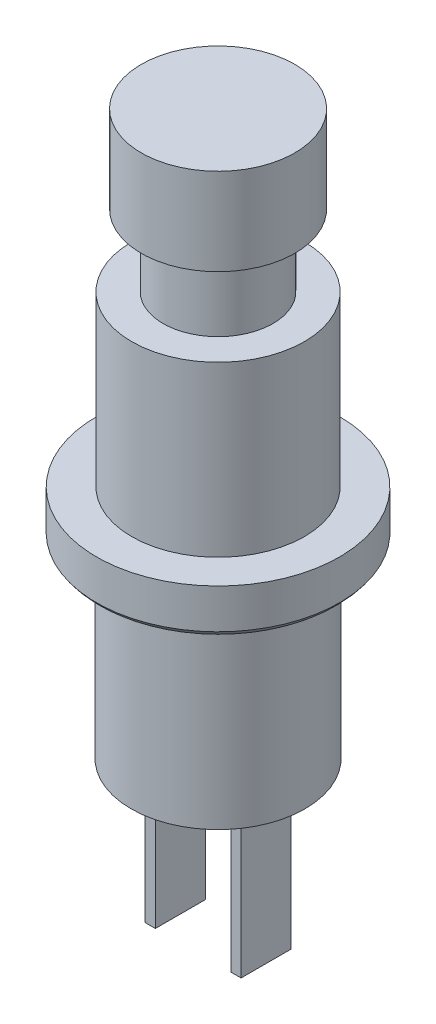
ISO-10303-21;
HEADER;
FILE_DESCRIPTION(('STEP AP214'),'2;1');
FILE_NAME('part.step','',(''),(''),'','','');
FILE_SCHEMA(('AUTOMOTIVE_DESIGN { 1 0 10303 214 1 1 1 1 }'));
ENDSEC;
DATA;
#1=APPLICATION_CONTEXT('core data for automotive mechanical design processes');
#2=APPLICATION_PROTOCOL_DEFINITION('international standard','automotive_design',2000,#1);
#3=PRODUCT_CONTEXT('',#1,'mechanical');
#4=PRODUCT('Part','Part','',(#3));
#5=PRODUCT_RELATED_PRODUCT_CATEGORY('part','',(#4));
#6=PRODUCT_DEFINITION_FORMATION('','',#4);
#7=PRODUCT_DEFINITION_CONTEXT('part definition',#1,'design');
#8=PRODUCT_DEFINITION('design','',#6,#7);
#9=PRODUCT_DEFINITION_SHAPE('','',#8);
#10=(LENGTH_UNIT() NAMED_UNIT(*) SI_UNIT(.MILLI.,.METRE.));
#11=(NAMED_UNIT(*) PLANE_ANGLE_UNIT() SI_UNIT($,.RADIAN.));
#12=(NAMED_UNIT(*) SI_UNIT($,.STERADIAN.) SOLID_ANGLE_UNIT());
#13=UNCERTAINTY_MEASURE_WITH_UNIT(LENGTH_MEASURE(1.E-05),#10,'distance_accuracy_value','');
#14=(GEOMETRIC_REPRESENTATION_CONTEXT(3) GLOBAL_UNCERTAINTY_ASSIGNED_CONTEXT((#13)) GLOBAL_UNIT_ASSIGNED_CONTEXT((#10,
#11,#12)) REPRESENTATION_CONTEXT('',''));
#15=CARTESIAN_POINT('',(0.,0.,0.));
#16=DIRECTION('',(0.,0.,1.));
#17=DIRECTION('',(1.,0.,0.));
#18=AXIS2_PLACEMENT_3D('',#15,#16,#17);
#19=CARTESIAN_POINT('',(3.4,-22.,0.));
#20=DIRECTION('',(0.,-1.,0.));
#21=DIRECTION('',(0.,0.,-1.));
#22=AXIS2_PLACEMENT_3D('',#19,#20,#21);
#23=PLANE('',#22);
#24=CARTESIAN_POINT('',(0.,-22.,0.));
#25=DIRECTION('',(0.,-1.,0.));
#26=DIRECTION('',(0.,0.,-1.));
#27=AXIS2_PLACEMENT_3D('',#24,#25,#26);
#28=CIRCLE('',#27,3.4);
#29=CARTESIAN_POINT('',(0.,-22.,-3.4));
#30=VERTEX_POINT('',#29);
#31=EDGE_CURVE('E171',#30,#30,#28,.T.);
#32=ORIENTED_EDGE('',*,*,#31,.T.);
#33=EDGE_LOOP('',(#32));
#34=FACE_BOUND('',#33,.T.);
#35=DIRECTION('',(1.,0.,0.));
#36=VECTOR('',#35,1.);
#37=CARTESIAN_POINT('',(-1.875,-22.,-0.975));
#38=LINE('',#37,#36);
#39=CARTESIAN_POINT('',(-1.875,-22.,-0.975));
#40=VERTEX_POINT('',#39);
#41=CARTESIAN_POINT('',(-1.475,-22.,-0.975));
#42=VERTEX_POINT('',#41);
#43=EDGE_CURVE('E143',#40,#42,#38,.T.);
#44=ORIENTED_EDGE('',*,*,#43,.F.);
#45=DIRECTION('',(0.,0.,-1.));
#46=VECTOR('',#45,1.);
#47=CARTESIAN_POINT('',(-1.875,-22.,0.975));
#48=LINE('',#47,#46);
#49=CARTESIAN_POINT('',(-1.875,-22.,0.975));
#50=VERTEX_POINT('',#49);
#51=EDGE_CURVE('E140',#50,#40,#48,.T.);
#52=ORIENTED_EDGE('',*,*,#51,.F.);
#53=DIRECTION('',(-1.,0.,0.));
#54=VECTOR('',#53,1.);
#55=CARTESIAN_POINT('',(-1.875,-22.,0.975));
#56=LINE('',#55,#54);
#57=CARTESIAN_POINT('',(-1.475,-22.,0.975));
#58=VERTEX_POINT('',#57);
#59=EDGE_CURVE('E152',#58,#50,#56,.T.);
#60=ORIENTED_EDGE('',*,*,#59,.F.);
#61=DIRECTION('',(0.,0.,1.));
#62=VECTOR('',#61,1.);
#63=CARTESIAN_POINT('',(-1.475,-22.,0.975));
#64=LINE('',#63,#62);
#65=EDGE_CURVE('E160',#42,#58,#64,.T.);
#66=ORIENTED_EDGE('',*,*,#65,.F.);
#67=EDGE_LOOP('',(#44,#52,#60,#66));
#68=FACE_BOUND('',#67,.T.);
#69=DIRECTION('',(1.,0.,0.));
#70=VECTOR('',#69,1.);
#71=CARTESIAN_POINT('',(1.475,-22.,-0.975));
#72=LINE('',#71,#70);
#73=CARTESIAN_POINT('',(1.475,-22.,-0.975));
#74=VERTEX_POINT('',#73);
#75=CARTESIAN_POINT('',(1.875,-22.,-0.975));
#76=VERTEX_POINT('',#75);
#77=EDGE_CURVE('E434',#74,#76,#72,.T.);
#78=ORIENTED_EDGE('',*,*,#77,.F.);
#79=DIRECTION('',(0.,0.,-1.));
#80=VECTOR('',#79,1.);
#81=CARTESIAN_POINT('',(1.475,-22.,0.975));
#82=LINE('',#81,#80);
#83=CARTESIAN_POINT('',(1.475,-22.,0.975));
#84=VERTEX_POINT('',#83);
#85=EDGE_CURVE('E138',#84,#74,#82,.T.);
#86=ORIENTED_EDGE('',*,*,#85,.F.);
#87=DIRECTION('',(-1.,0.,0.));
#88=VECTOR('',#87,1.);
#89=CARTESIAN_POINT('',(1.475,-22.,0.975));
#90=LINE('',#89,#88);
#91=CARTESIAN_POINT('',(1.875,-22.,0.975));
#92=VERTEX_POINT('',#91);
#93=EDGE_CURVE('E134',#92,#84,#90,.T.);
#94=ORIENTED_EDGE('',*,*,#93,.F.);
#95=DIRECTION('',(0.,0.,1.));
#96=VECTOR('',#95,1.);
#97=CARTESIAN_POINT('',(1.875,-22.,0.975));
#98=LINE('',#97,#96);
#99=EDGE_CURVE('E431',#76,#92,#98,.T.);
#100=ORIENTED_EDGE('',*,*,#99,.F.);
#101=EDGE_LOOP('',(#78,#86,#94,#100));
#102=FACE_BOUND('',#101,.T.);
#103=ADVANCED_FACE('F49',(#34,#68,#102),#23,.T.);
#104=CARTESIAN_POINT('',(0.,0.,0.));
#105=DIRECTION('',(0.,1.,0.));
#106=DIRECTION('',(0.,0.,1.));
#107=AXIS2_PLACEMENT_3D('',#104,#105,#106);
#108=PLANE('',#107);
#109=CARTESIAN_POINT('',(0.,0.,0.));
#110=DIRECTION('',(0.,-1.,0.));
#111=DIRECTION('',(0.,0.,-1.));
#112=AXIS2_PLACEMENT_3D('',#109,#110,#111);
#113=CIRCLE('',#112,3.);
#114=CARTESIAN_POINT('',(0.,0.,-3.));
#115=VERTEX_POINT('',#114);
#116=EDGE_CURVE('E13',#115,#115,#113,.T.);
#117=ORIENTED_EDGE('',*,*,#116,.F.);
#118=EDGE_LOOP('',(#117));
#119=FACE_BOUND('',#118,.T.);
#120=ADVANCED_FACE('F51',(#119),#108,.T.);
#121=CARTESIAN_POINT('',(0.,-223.6231578964,0.));
#122=DIRECTION('',(0.,-1.,0.));
#123=DIRECTION('',(0.,0.,-1.));
#124=AXIS2_PLACEMENT_3D('',#121,#122,#123);
#125=CYLINDRICAL_SURFACE('',#124,3.);
#126=ORIENTED_EDGE('',*,*,#116,.T.);
#127=EDGE_LOOP('',(#126));
#128=FACE_BOUND('',#127,.T.);
#129=CARTESIAN_POINT('',(0.,-3.39999999999999,0.));
#130=DIRECTION('',(0.,-1.,0.));
#131=DIRECTION('',(0.,0.,-1.));
#132=AXIS2_PLACEMENT_3D('',#129,#130,#131);
#133=CIRCLE('',#132,3.);
#134=CARTESIAN_POINT('',(0.,-3.39999999999999,-3.));
#135=VERTEX_POINT('',#134);
#136=EDGE_CURVE('E57',#135,#135,#133,.T.);
#137=ORIENTED_EDGE('',*,*,#136,.F.);
#138=EDGE_LOOP('',(#137));
#139=FACE_BOUND('',#138,.T.);
#140=ADVANCED_FACE('F203',(#128,#139),#125,.T.);
#141=CARTESIAN_POINT('',(3.,-3.4,0.));
#142=DIRECTION('',(0.,-1.,0.));
#143=DIRECTION('',(0.,0.,-1.));
#144=AXIS2_PLACEMENT_3D('',#141,#142,#143);
#145=PLANE('',#144);
#146=ORIENTED_EDGE('',*,*,#136,.T.);
#147=EDGE_LOOP('',(#146));
#148=FACE_BOUND('',#147,.T.);
#149=CARTESIAN_POINT('',(0.,-3.39999999999999,0.));
#150=DIRECTION('',(0.,-1.,0.));
#151=DIRECTION('',(0.,0.,-1.));
#152=AXIS2_PLACEMENT_3D('',#149,#150,#151);
#153=CIRCLE('',#152,2.15);
#154=CARTESIAN_POINT('',(0.,-3.39999999999999,-2.15));
#155=VERTEX_POINT('',#154);
#156=EDGE_CURVE('E195',#155,#155,#153,.T.);
#157=ORIENTED_EDGE('',*,*,#156,.F.);
#158=EDGE_LOOP('',(#157));
#159=FACE_BOUND('',#158,.T.);
#160=ADVANCED_FACE('F200',(#148,#159),#145,.T.);
#161=CARTESIAN_POINT('',(0.,-223.6231578964,0.));
#162=DIRECTION('',(0.,-1.,0.));
#163=DIRECTION('',(0.,0.,-1.));
#164=AXIS2_PLACEMENT_3D('',#161,#162,#163);
#165=CYLINDRICAL_SURFACE('',#164,2.15);
#166=ORIENTED_EDGE('',*,*,#156,.T.);
#167=EDGE_LOOP('',(#166));
#168=FACE_BOUND('',#167,.T.);
#169=CARTESIAN_POINT('',(0.,-6.20000000000001,0.));
#170=DIRECTION('',(0.,-1.,0.));
#171=DIRECTION('',(0.,0.,-1.));
#172=AXIS2_PLACEMENT_3D('',#169,#170,#171);
#173=CIRCLE('',#172,2.15);
#174=CARTESIAN_POINT('',(0.,-6.20000000000001,-2.15));
#175=VERTEX_POINT('',#174);
#176=EDGE_CURVE('E192',#175,#175,#173,.T.);
#177=ORIENTED_EDGE('',*,*,#176,.F.);
#178=EDGE_LOOP('',(#177));
#179=FACE_BOUND('',#178,.T.);
#180=ADVANCED_FACE('F210',(#168,#179),#165,.T.);
#181=CARTESIAN_POINT('',(2.15,-6.2,0.));
#182=DIRECTION('',(0.,1.,0.));
#183=DIRECTION('',(0.,0.,1.));
#184=AXIS2_PLACEMENT_3D('',#181,#182,#183);
#185=PLANE('',#184);
#186=ORIENTED_EDGE('',*,*,#176,.T.);
#187=EDGE_LOOP('',(#186));
#188=FACE_BOUND('',#187,.T.);
#189=CARTESIAN_POINT('',(0.,-6.20000000000001,0.));
#190=DIRECTION('',(0.,-1.,0.));
#191=DIRECTION('',(0.,0.,-1.));
#192=AXIS2_PLACEMENT_3D('',#189,#190,#191);
#193=CIRCLE('',#192,3.375);
#194=CARTESIAN_POINT('',(0.,-6.20000000000001,-3.375));
#195=VERTEX_POINT('',#194);
#196=EDGE_CURVE('E189',#195,#195,#193,.T.);
#197=ORIENTED_EDGE('',*,*,#196,.F.);
#198=EDGE_LOOP('',(#197));
#199=FACE_BOUND('',#198,.T.);
#200=ADVANCED_FACE('F246',(#188,#199),#185,.T.);
#201=CARTESIAN_POINT('',(0.,-223.6231578964,0.));
#202=DIRECTION('',(0.,-1.,0.));
#203=DIRECTION('',(0.,0.,-1.));
#204=AXIS2_PLACEMENT_3D('',#201,#202,#203);
#205=CYLINDRICAL_SURFACE('',#204,3.375);
#206=ORIENTED_EDGE('',*,*,#196,.T.);
#207=EDGE_LOOP('',(#206));
#208=FACE_BOUND('',#207,.T.);
#209=CARTESIAN_POINT('',(0.,-12.8,0.));
#210=DIRECTION('',(0.,-1.,0.));
#211=DIRECTION('',(0.,0.,-1.));
#212=AXIS2_PLACEMENT_3D('',#209,#210,#211);
#213=CIRCLE('',#212,3.375);
#214=CARTESIAN_POINT('',(0.,-12.8,-3.375));
#215=VERTEX_POINT('',#214);
#216=EDGE_CURVE('E186',#215,#215,#213,.T.);
#217=ORIENTED_EDGE('',*,*,#216,.F.);
#218=EDGE_LOOP('',(#217));
#219=FACE_BOUND('',#218,.T.);
#220=ADVANCED_FACE('F242',(#208,#219),#205,.T.);
#221=CARTESIAN_POINT('',(3.375,-12.8,0.));
#222=DIRECTION('',(0.,1.,0.));
#223=DIRECTION('',(0.,0.,1.));
#224=AXIS2_PLACEMENT_3D('',#221,#222,#223);
#225=PLANE('',#224);
#226=ORIENTED_EDGE('',*,*,#216,.T.);
#227=EDGE_LOOP('',(#226));
#228=FACE_BOUND('',#227,.T.);
#229=CARTESIAN_POINT('',(0.,-12.8,0.));
#230=DIRECTION('',(0.,-1.,0.));
#231=DIRECTION('',(0.,0.,-1.));
#232=AXIS2_PLACEMENT_3D('',#229,#230,#231);
#233=CIRCLE('',#232,4.75);
#234=CARTESIAN_POINT('',(0.,-12.8,-4.75));
#235=VERTEX_POINT('',#234);
#236=EDGE_CURVE('E183',#235,#235,#233,.T.);
#237=ORIENTED_EDGE('',*,*,#236,.F.);
#238=EDGE_LOOP('',(#237));
#239=FACE_BOUND('',#238,.T.);
#240=ADVANCED_FACE('F238',(#228,#239),#225,.T.);
#241=CARTESIAN_POINT('',(0.,-223.6231578964,0.));
#242=DIRECTION('',(0.,-1.,0.));
#243=DIRECTION('',(0.,0.,-1.));
#244=AXIS2_PLACEMENT_3D('',#241,#242,#243);
#245=CYLINDRICAL_SURFACE('',#244,4.75);
#246=ORIENTED_EDGE('',*,*,#236,.T.);
#247=EDGE_LOOP('',(#246));
#248=FACE_BOUND('',#247,.T.);
#249=CARTESIAN_POINT('',(0.,-14.35,0.));
#250=DIRECTION('',(0.,-1.,0.));
#251=DIRECTION('',(0.,0.,-1.));
#252=AXIS2_PLACEMENT_3D('',#249,#250,#251);
#253=CIRCLE('',#252,4.75);
#254=CARTESIAN_POINT('',(0.,-14.35,-4.75));
#255=VERTEX_POINT('',#254);
#256=EDGE_CURVE('E180',#255,#255,#253,.T.);
#257=ORIENTED_EDGE('',*,*,#256,.F.);
#258=EDGE_LOOP('',(#257));
#259=FACE_BOUND('',#258,.T.);
#260=ADVANCED_FACE('F234',(#248,#259),#245,.T.);
#261=CARTESIAN_POINT('',(0.,-13.8,0.));
#262=DIRECTION('',(0.,-1.,0.));
#263=DIRECTION('',(0.,0.,-1.));
#264=AXIS2_PLACEMENT_3D('',#261,#262,#263);
#265=TOROIDAL_SURFACE('',#264,3.9148353455755,1.);
#266=ORIENTED_EDGE('',*,*,#256,.T.);
#267=EDGE_LOOP('',(#266));
#268=FACE_BOUND('',#267,.T.);
#269=CARTESIAN_POINT('',(0.,-14.8,0.));
#270=DIRECTION('',(0.,-1.,0.));
#271=DIRECTION('',(0.,0.,-1.));
#272=AXIS2_PLACEMENT_3D('',#269,#270,#271);
#273=CIRCLE('',#272,3.9148353455755);
#274=CARTESIAN_POINT('',(0.,-14.8,-3.9148353455755));
#275=VERTEX_POINT('',#274);
#276=EDGE_CURVE('E177',#275,#275,#273,.T.);
#277=ORIENTED_EDGE('',*,*,#276,.F.);
#278=EDGE_LOOP('',(#277));
#279=FACE_BOUND('',#278,.T.);
#280=ADVANCED_FACE('F230',(#268,#279),#265,.T.);
#281=CARTESIAN_POINT('',(3.9148353455755,-14.8,0.));
#282=DIRECTION('',(0.,-1.,0.));
#283=DIRECTION('',(0.,0.,-1.));
#284=AXIS2_PLACEMENT_3D('',#281,#282,#283);
#285=PLANE('',#284);
#286=ORIENTED_EDGE('',*,*,#276,.T.);
#287=EDGE_LOOP('',(#286));
#288=FACE_BOUND('',#287,.T.);
#289=CARTESIAN_POINT('',(0.,-14.8,0.));
#290=DIRECTION('',(0.,-1.,0.));
#291=DIRECTION('',(0.,0.,-1.));
#292=AXIS2_PLACEMENT_3D('',#289,#290,#291);
#293=CIRCLE('',#292,3.4);
#294=CARTESIAN_POINT('',(0.,-14.8,-3.4));
#295=VERTEX_POINT('',#294);
#296=EDGE_CURVE('E174',#295,#295,#293,.T.);
#297=ORIENTED_EDGE('',*,*,#296,.F.);
#298=EDGE_LOOP('',(#297));
#299=FACE_BOUND('',#298,.T.);
#300=ADVANCED_FACE('F226',(#288,#299),#285,.T.);
#301=CARTESIAN_POINT('',(0.,-223.6231578964,0.));
#302=DIRECTION('',(0.,-1.,0.));
#303=DIRECTION('',(0.,0.,-1.));
#304=AXIS2_PLACEMENT_3D('',#301,#302,#303);
#305=CYLINDRICAL_SURFACE('',#304,3.4);
#306=ORIENTED_EDGE('',*,*,#296,.T.);
#307=EDGE_LOOP('',(#306));
#308=FACE_BOUND('',#307,.T.);
#309=ORIENTED_EDGE('',*,*,#31,.F.);
#310=EDGE_LOOP('',(#309));
#311=FACE_BOUND('',#310,.T.);
#312=ADVANCED_FACE('F223',(#308,#311),#305,.T.);
#313=CARTESIAN_POINT('',(-1.875,-28.,0.975));
#314=DIRECTION('',(1.,0.,0.));
#315=DIRECTION('',(0.,0.,-1.));
#316=AXIS2_PLACEMENT_3D('',#313,#314,#315);
#317=PLANE('',#316);
#318=ORIENTED_EDGE('',*,*,#51,.T.);
#319=DIRECTION('',(0.,1.,0.));
#320=VECTOR('',#319,1.);
#321=CARTESIAN_POINT('',(-1.875,-28.,-0.975));
#322=LINE('',#321,#320);
#323=CARTESIAN_POINT('',(-1.875,-28.,-0.975));
#324=VERTEX_POINT('',#323);
#325=EDGE_CURVE('E169',#324,#40,#322,.T.);
#326=ORIENTED_EDGE('',*,*,#325,.F.);
#327=DIRECTION('',(0.,0.,-1.));
#328=VECTOR('',#327,1.);
#329=CARTESIAN_POINT('',(-1.875,-28.,0.975));
#330=LINE('',#329,#328);
#331=CARTESIAN_POINT('',(-1.875,-28.,0.975));
#332=VERTEX_POINT('',#331);
#333=EDGE_CURVE('E148',#332,#324,#330,.T.);
#334=ORIENTED_EDGE('',*,*,#333,.F.);
#335=DIRECTION('',(0.,1.,0.));
#336=VECTOR('',#335,1.);
#337=CARTESIAN_POINT('',(-1.875,-28.,0.975));
#338=LINE('',#337,#336);
#339=EDGE_CURVE('E157',#332,#50,#338,.T.);
#340=ORIENTED_EDGE('',*,*,#339,.T.);
#341=EDGE_LOOP('',(#318,#326,#334,#340));
#342=FACE_BOUND('',#341,.T.);
#343=ADVANCED_FACE('F221',(#342),#317,.F.);
#344=CARTESIAN_POINT('',(-1.875,-28.,-0.975));
#345=DIRECTION('',(0.,0.,1.));
#346=DIRECTION('',(1.,0.,0.));
#347=AXIS2_PLACEMENT_3D('',#344,#345,#346);
#348=PLANE('',#347);
#349=ORIENTED_EDGE('',*,*,#43,.T.);
#350=DIRECTION('',(0.,1.,0.));
#351=VECTOR('',#350,1.);
#352=CARTESIAN_POINT('',(-1.475,-28.,-0.975));
#353=LINE('',#352,#351);
#354=CARTESIAN_POINT('',(-1.475,-28.,-0.975));
#355=VERTEX_POINT('',#354);
#356=EDGE_CURVE('E166',#355,#42,#353,.T.);
#357=ORIENTED_EDGE('',*,*,#356,.F.);
#358=DIRECTION('',(1.,0.,0.));
#359=VECTOR('',#358,1.);
#360=CARTESIAN_POINT('',(-1.875,-28.,-0.975));
#361=LINE('',#360,#359);
#362=EDGE_CURVE('E151',#324,#355,#361,.T.);
#363=ORIENTED_EDGE('',*,*,#362,.F.);
#364=ORIENTED_EDGE('',*,*,#325,.T.);
#365=EDGE_LOOP('',(#349,#357,#363,#364));
#366=FACE_BOUND('',#365,.T.);
#367=ADVANCED_FACE('F308',(#366),#348,.F.);
#368=CARTESIAN_POINT('',(-1.475,-28.,0.975));
#369=DIRECTION('',(-1.,0.,0.));
#370=DIRECTION('',(0.,0.,1.));
#371=AXIS2_PLACEMENT_3D('',#368,#369,#370);
#372=PLANE('',#371);
#373=ORIENTED_EDGE('',*,*,#65,.T.);
#374=DIRECTION('',(0.,1.,0.));
#375=VECTOR('',#374,1.);
#376=CARTESIAN_POINT('',(-1.475,-28.,0.975));
#377=LINE('',#376,#375);
#378=CARTESIAN_POINT('',(-1.475,-28.,0.975));
#379=VERTEX_POINT('',#378);
#380=EDGE_CURVE('E72',#379,#58,#377,.T.);
#381=ORIENTED_EDGE('',*,*,#380,.F.);
#382=DIRECTION('',(0.,0.,1.));
#383=VECTOR('',#382,1.);
#384=CARTESIAN_POINT('',(-1.475,-28.,0.975));
#385=LINE('',#384,#383);
#386=EDGE_CURVE('E154',#355,#379,#385,.T.);
#387=ORIENTED_EDGE('',*,*,#386,.F.);
#388=ORIENTED_EDGE('',*,*,#356,.T.);
#389=EDGE_LOOP('',(#373,#381,#387,#388));
#390=FACE_BOUND('',#389,.T.);
#391=ADVANCED_FACE('F315',(#390),#372,.F.);
#392=CARTESIAN_POINT('',(-1.875,-28.,0.975));
#393=DIRECTION('',(0.,0.,-1.));
#394=DIRECTION('',(-1.,0.,0.));
#395=AXIS2_PLACEMENT_3D('',#392,#393,#394);
#396=PLANE('',#395);
#397=ORIENTED_EDGE('',*,*,#59,.T.);
#398=ORIENTED_EDGE('',*,*,#339,.F.);
#399=DIRECTION('',(-1.,0.,0.));
#400=VECTOR('',#399,1.);
#401=CARTESIAN_POINT('',(-1.875,-28.,0.975));
#402=LINE('',#401,#400);
#403=EDGE_CURVE('E156',#379,#332,#402,.T.);
#404=ORIENTED_EDGE('',*,*,#403,.F.);
#405=ORIENTED_EDGE('',*,*,#380,.T.);
#406=EDGE_LOOP('',(#397,#398,#404,#405));
#407=FACE_BOUND('',#406,.T.);
#408=ADVANCED_FACE('F322',(#407),#396,.F.);
#409=CARTESIAN_POINT('',(0.,-28.,0.));
#410=DIRECTION('',(0.,-1.,0.));
#411=DIRECTION('',(0.,0.,-1.));
#412=AXIS2_PLACEMENT_3D('',#409,#410,#411);
#413=PLANE('',#412);
#414=ORIENTED_EDGE('',*,*,#333,.T.);
#415=ORIENTED_EDGE('',*,*,#362,.T.);
#416=ORIENTED_EDGE('',*,*,#386,.T.);
#417=ORIENTED_EDGE('',*,*,#403,.T.);
#418=EDGE_LOOP('',(#414,#415,#416,#417));
#419=FACE_BOUND('',#418,.T.);
#420=ADVANCED_FACE('F330',(#419),#413,.T.);
#421=CARTESIAN_POINT('',(1.475,-28.,0.975));
#422=DIRECTION('',(1.,0.,0.));
#423=DIRECTION('',(0.,0.,-1.));
#424=AXIS2_PLACEMENT_3D('',#421,#422,#423);
#425=PLANE('',#424);
#426=ORIENTED_EDGE('',*,*,#85,.T.);
#427=DIRECTION('',(0.,1.,0.));
#428=VECTOR('',#427,1.);
#429=CARTESIAN_POINT('',(1.475,-28.,-0.975));
#430=LINE('',#429,#428);
#431=CARTESIAN_POINT('',(1.475,-28.,-0.975));
#432=VERTEX_POINT('',#431);
#433=EDGE_CURVE('E119',#432,#74,#430,.T.);
#434=ORIENTED_EDGE('',*,*,#433,.F.);
#435=DIRECTION('',(0.,0.,-1.));
#436=VECTOR('',#435,1.);
#437=CARTESIAN_POINT('',(1.475,-28.,0.975));
#438=LINE('',#437,#436);
#439=CARTESIAN_POINT('',(1.475,-28.,0.975));
#440=VERTEX_POINT('',#439);
#441=EDGE_CURVE('E126',#440,#432,#438,.T.);
#442=ORIENTED_EDGE('',*,*,#441,.F.);
#443=DIRECTION('',(0.,1.,0.));
#444=VECTOR('',#443,1.);
#445=CARTESIAN_POINT('',(1.475,-28.,0.975));
#446=LINE('',#445,#444);
#447=EDGE_CURVE('E428',#440,#84,#446,.T.);
#448=ORIENTED_EDGE('',*,*,#447,.T.);
#449=EDGE_LOOP('',(#426,#434,#442,#448));
#450=FACE_BOUND('',#449,.T.);
#451=ADVANCED_FACE('F136',(#450),#425,.F.);
#452=CARTESIAN_POINT('',(1.475,-28.,-0.975));
#453=DIRECTION('',(0.,0.,1.));
#454=DIRECTION('',(1.,0.,0.));
#455=AXIS2_PLACEMENT_3D('',#452,#453,#454);
#456=PLANE('',#455);
#457=ORIENTED_EDGE('',*,*,#77,.T.);
#458=DIRECTION('',(0.,1.,0.));
#459=VECTOR('',#458,1.);
#460=CARTESIAN_POINT('',(1.875,-28.,-0.975));
#461=LINE('',#460,#459);
#462=CARTESIAN_POINT('',(1.875,-28.,-0.975));
#463=VERTEX_POINT('',#462);
#464=EDGE_CURVE('E122',#463,#76,#461,.T.);
#465=ORIENTED_EDGE('',*,*,#464,.F.);
#466=DIRECTION('',(1.,0.,0.));
#467=VECTOR('',#466,1.);
#468=CARTESIAN_POINT('',(1.475,-28.,-0.975));
#469=LINE('',#468,#467);
#470=EDGE_CURVE('E115',#432,#463,#469,.T.);
#471=ORIENTED_EDGE('',*,*,#470,.F.);
#472=ORIENTED_EDGE('',*,*,#433,.T.);
#473=EDGE_LOOP('',(#457,#465,#471,#472));
#474=FACE_BOUND('',#473,.T.);
#475=ADVANCED_FACE('F117',(#474),#456,.F.);
#476=CARTESIAN_POINT('',(1.875,-28.,0.975));
#477=DIRECTION('',(-1.,0.,0.));
#478=DIRECTION('',(0.,0.,1.));
#479=AXIS2_PLACEMENT_3D('',#476,#477,#478);
#480=PLANE('',#479);
#481=ORIENTED_EDGE('',*,*,#99,.T.);
#482=DIRECTION('',(0.,1.,0.));
#483=VECTOR('',#482,1.);
#484=CARTESIAN_POINT('',(1.875,-28.,0.975));
#485=LINE('',#484,#483);
#486=CARTESIAN_POINT('',(1.875,-28.,0.975));
#487=VERTEX_POINT('',#486);
#488=EDGE_CURVE('E64',#487,#92,#485,.T.);
#489=ORIENTED_EDGE('',*,*,#488,.F.);
#490=DIRECTION('',(0.,0.,1.));
#491=VECTOR('',#490,1.);
#492=CARTESIAN_POINT('',(1.875,-28.,0.975));
#493=LINE('',#492,#491);
#494=EDGE_CURVE('E125',#463,#487,#493,.T.);
#495=ORIENTED_EDGE('',*,*,#494,.F.);
#496=ORIENTED_EDGE('',*,*,#464,.T.);
#497=EDGE_LOOP('',(#481,#489,#495,#496));
#498=FACE_BOUND('',#497,.T.);
#499=ADVANCED_FACE('F350',(#498),#480,.F.);
#500=CARTESIAN_POINT('',(1.475,-28.,0.975));
#501=DIRECTION('',(0.,0.,-1.));
#502=DIRECTION('',(-1.,0.,0.));
#503=AXIS2_PLACEMENT_3D('',#500,#501,#502);
#504=PLANE('',#503);
#505=ORIENTED_EDGE('',*,*,#93,.T.);
#506=ORIENTED_EDGE('',*,*,#447,.F.);
#507=DIRECTION('',(-1.,0.,0.));
#508=VECTOR('',#507,1.);
#509=CARTESIAN_POINT('',(1.475,-28.,0.975));
#510=LINE('',#509,#508);
#511=EDGE_CURVE('E130',#487,#440,#510,.T.);
#512=ORIENTED_EDGE('',*,*,#511,.F.);
#513=ORIENTED_EDGE('',*,*,#488,.T.);
#514=EDGE_LOOP('',(#505,#506,#512,#513));
#515=FACE_BOUND('',#514,.T.);
#516=ADVANCED_FACE('F357',(#515),#504,.F.);
#517=CARTESIAN_POINT('',(0.,-28.,0.));
#518=DIRECTION('',(0.,-1.,0.));
#519=DIRECTION('',(0.,0.,-1.));
#520=AXIS2_PLACEMENT_3D('',#517,#518,#519);
#521=PLANE('',#520);
#522=ORIENTED_EDGE('',*,*,#441,.T.);
#523=ORIENTED_EDGE('',*,*,#470,.T.);
#524=ORIENTED_EDGE('',*,*,#494,.T.);
#525=ORIENTED_EDGE('',*,*,#511,.T.);
#526=EDGE_LOOP('',(#522,#523,#524,#525));
#527=FACE_BOUND('',#526,.T.);
#528=ADVANCED_FACE('F129',(#527),#521,.T.);
#529=CLOSED_SHELL('',(#103,#120,#140,#160,#180,#200,#220,#240,#260,#280,#300,#312,#343,#367,
#391,#408,#420,#451,#475,#499,#516,#528));
#530=MANIFOLD_SOLID_BREP('B2',#529);
#531=ADVANCED_BREP_SHAPE_REPRESENTATION('',(#18,#530),#14);
#532=SHAPE_DEFINITION_REPRESENTATION(#9,#531);
ENDSEC;
END-ISO-10303-21;
